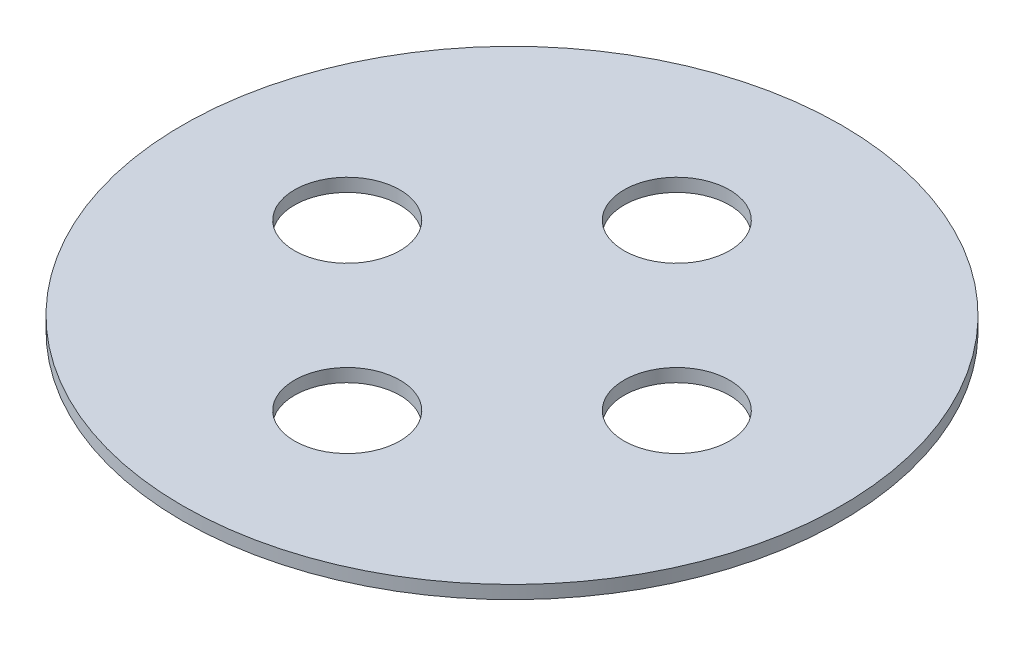
ISO-10303-21;
HEADER;
FILE_DESCRIPTION(('STEP AP214'),'2;1');
FILE_NAME('part.step','',(''),(''),'','','');
FILE_SCHEMA(('AUTOMOTIVE_DESIGN { 1 0 10303 214 1 1 1 1 }'));
ENDSEC;
DATA;
#1=APPLICATION_CONTEXT('core data for automotive mechanical design processes');
#2=APPLICATION_PROTOCOL_DEFINITION('international standard','automotive_design',2000,#1);
#3=PRODUCT_CONTEXT('',#1,'mechanical');
#4=PRODUCT('Part','Part','',(#3));
#5=PRODUCT_RELATED_PRODUCT_CATEGORY('part','',(#4));
#6=PRODUCT_DEFINITION_FORMATION('','',#4);
#7=PRODUCT_DEFINITION_CONTEXT('part definition',#1,'design');
#8=PRODUCT_DEFINITION('design','',#6,#7);
#9=PRODUCT_DEFINITION_SHAPE('','',#8);
#10=(LENGTH_UNIT() NAMED_UNIT(*) SI_UNIT(.MILLI.,.METRE.));
#11=(NAMED_UNIT(*) PLANE_ANGLE_UNIT() SI_UNIT($,.RADIAN.));
#12=(NAMED_UNIT(*) SI_UNIT($,.STERADIAN.) SOLID_ANGLE_UNIT());
#13=UNCERTAINTY_MEASURE_WITH_UNIT(LENGTH_MEASURE(1.E-05),#10,'distance_accuracy_value','');
#14=(GEOMETRIC_REPRESENTATION_CONTEXT(3) GLOBAL_UNCERTAINTY_ASSIGNED_CONTEXT((#13)) GLOBAL_UNIT_ASSIGNED_CONTEXT((#10,
#11,#12)) REPRESENTATION_CONTEXT('',''));
#15=CARTESIAN_POINT('',(0.,0.,0.));
#16=DIRECTION('',(0.,0.,1.));
#17=DIRECTION('',(1.,0.,0.));
#18=AXIS2_PLACEMENT_3D('',#15,#16,#17);
#19=CARTESIAN_POINT('',(0.,1.,0.));
#20=DIRECTION('',(0.,-1.,0.));
#21=DIRECTION('',(0.,0.,-1.));
#22=AXIS2_PLACEMENT_3D('',#19,#20,#21);
#23=CYLINDRICAL_SURFACE('',#22,25.);
#24=CARTESIAN_POINT('',(0.,1.,0.));
#25=DIRECTION('',(0.,1.,0.));
#26=DIRECTION('',(0.,0.,1.));
#27=AXIS2_PLACEMENT_3D('',#24,#25,#26);
#28=CIRCLE('',#27,25.);
#29=CARTESIAN_POINT('',(0.,1.,25.));
#30=VERTEX_POINT('',#29);
#31=EDGE_CURVE('E10',#30,#30,#28,.T.);
#32=ORIENTED_EDGE('',*,*,#31,.F.);
#33=EDGE_LOOP('',(#32));
#34=FACE_BOUND('',#33,.T.);
#35=CARTESIAN_POINT('',(0.,0.,0.));
#36=DIRECTION('',(0.,1.,0.));
#37=DIRECTION('',(0.,0.,1.));
#38=AXIS2_PLACEMENT_3D('',#35,#36,#37);
#39=CIRCLE('',#38,25.);
#40=CARTESIAN_POINT('',(0.,0.,25.));
#41=VERTEX_POINT('',#40);
#42=EDGE_CURVE('E40',#41,#41,#39,.T.);
#43=ORIENTED_EDGE('',*,*,#42,.T.);
#44=EDGE_LOOP('',(#43));
#45=FACE_BOUND('',#44,.T.);
#46=ADVANCED_FACE('F37',(#34,#45),#23,.T.);
#47=CARTESIAN_POINT('',(0.,1.,0.));
#48=DIRECTION('',(0.,1.,0.));
#49=DIRECTION('',(0.,0.,1.));
#50=AXIS2_PLACEMENT_3D('',#47,#48,#49);
#51=PLANE('',#50);
#52=CARTESIAN_POINT('',(0.,1.,-12.5));
#53=DIRECTION('',(0.,1.,0.));
#54=DIRECTION('',(0.,0.,1.));
#55=AXIS2_PLACEMENT_3D('',#52,#53,#54);
#56=CIRCLE('',#55,4.);
#57=CARTESIAN_POINT('',(0.,1.,-8.5));
#58=VERTEX_POINT('',#57);
#59=EDGE_CURVE('E75',#58,#58,#56,.T.);
#60=ORIENTED_EDGE('',*,*,#59,.F.);
#61=EDGE_LOOP('',(#60));
#62=FACE_BOUND('',#61,.T.);
#63=CARTESIAN_POINT('',(12.5,1.,0.));
#64=DIRECTION('',(0.,1.,0.));
#65=DIRECTION('',(0.,0.,1.));
#66=AXIS2_PLACEMENT_3D('',#63,#64,#65);
#67=CIRCLE('',#66,4.);
#68=CARTESIAN_POINT('',(12.5,1.,4.));
#69=VERTEX_POINT('',#68);
#70=EDGE_CURVE('E67',#69,#69,#67,.T.);
#71=ORIENTED_EDGE('',*,*,#70,.F.);
#72=EDGE_LOOP('',(#71));
#73=FACE_BOUND('',#72,.T.);
#74=CARTESIAN_POINT('',(-12.5,1.,0.));
#75=DIRECTION('',(0.,1.,0.));
#76=DIRECTION('',(0.,0.,1.));
#77=AXIS2_PLACEMENT_3D('',#74,#75,#76);
#78=CIRCLE('',#77,4.);
#79=CARTESIAN_POINT('',(-12.5,1.,4.));
#80=VERTEX_POINT('',#79);
#81=EDGE_CURVE('E59',#80,#80,#78,.T.);
#82=ORIENTED_EDGE('',*,*,#81,.F.);
#83=EDGE_LOOP('',(#82));
#84=FACE_BOUND('',#83,.T.);
#85=CARTESIAN_POINT('',(0.,1.,12.5));
#86=DIRECTION('',(0.,1.,0.));
#87=DIRECTION('',(0.,0.,1.));
#88=AXIS2_PLACEMENT_3D('',#85,#86,#87);
#89=CIRCLE('',#88,4.);
#90=CARTESIAN_POINT('',(0.,1.,16.5));
#91=VERTEX_POINT('',#90);
#92=EDGE_CURVE('E51',#91,#91,#89,.T.);
#93=ORIENTED_EDGE('',*,*,#92,.F.);
#94=EDGE_LOOP('',(#93));
#95=FACE_BOUND('',#94,.T.);
#96=ORIENTED_EDGE('',*,*,#31,.T.);
#97=EDGE_LOOP('',(#96));
#98=FACE_BOUND('',#97,.T.);
#99=ADVANCED_FACE('F93',(#62,#73,#84,#95,#98),#51,.T.);
#100=CARTESIAN_POINT('',(0.,0.,0.));
#101=DIRECTION('',(0.,1.,0.));
#102=DIRECTION('',(0.,0.,1.));
#103=AXIS2_PLACEMENT_3D('',#100,#101,#102);
#104=PLANE('',#103);
#105=CARTESIAN_POINT('',(0.,0.,-12.5));
#106=DIRECTION('',(0.,1.,0.));
#107=DIRECTION('',(0.,0.,1.));
#108=AXIS2_PLACEMENT_3D('',#105,#106,#107);
#109=CIRCLE('',#108,4.);
#110=CARTESIAN_POINT('',(0.,0.,-8.5));
#111=VERTEX_POINT('',#110);
#112=EDGE_CURVE('E49',#111,#111,#109,.T.);
#113=ORIENTED_EDGE('',*,*,#112,.T.);
#114=EDGE_LOOP('',(#113));
#115=FACE_BOUND('',#114,.T.);
#116=CARTESIAN_POINT('',(12.5,0.,0.));
#117=DIRECTION('',(0.,1.,0.));
#118=DIRECTION('',(0.,0.,1.));
#119=AXIS2_PLACEMENT_3D('',#116,#117,#118);
#120=CIRCLE('',#119,4.);
#121=CARTESIAN_POINT('',(12.5,0.,4.));
#122=VERTEX_POINT('',#121);
#123=EDGE_CURVE('E71',#122,#122,#120,.T.);
#124=ORIENTED_EDGE('',*,*,#123,.T.);
#125=EDGE_LOOP('',(#124));
#126=FACE_BOUND('',#125,.T.);
#127=CARTESIAN_POINT('',(-12.5,0.,0.));
#128=DIRECTION('',(0.,1.,0.));
#129=DIRECTION('',(0.,0.,1.));
#130=AXIS2_PLACEMENT_3D('',#127,#128,#129);
#131=CIRCLE('',#130,4.);
#132=CARTESIAN_POINT('',(-12.5,0.,4.));
#133=VERTEX_POINT('',#132);
#134=EDGE_CURVE('E63',#133,#133,#131,.T.);
#135=ORIENTED_EDGE('',*,*,#134,.T.);
#136=EDGE_LOOP('',(#135));
#137=FACE_BOUND('',#136,.T.);
#138=CARTESIAN_POINT('',(0.,0.,12.5));
#139=DIRECTION('',(0.,1.,0.));
#140=DIRECTION('',(0.,0.,1.));
#141=AXIS2_PLACEMENT_3D('',#138,#139,#140);
#142=CIRCLE('',#141,4.);
#143=CARTESIAN_POINT('',(0.,0.,16.5));
#144=VERTEX_POINT('',#143);
#145=EDGE_CURVE('E55',#144,#144,#142,.T.);
#146=ORIENTED_EDGE('',*,*,#145,.T.);
#147=EDGE_LOOP('',(#146));
#148=FACE_BOUND('',#147,.T.);
#149=ORIENTED_EDGE('',*,*,#42,.F.);
#150=EDGE_LOOP('',(#149));
#151=FACE_BOUND('',#150,.T.);
#152=ADVANCED_FACE('F83',(#115,#126,#137,#148,#151),#104,.F.);
#153=CARTESIAN_POINT('',(0.,0.,12.5));
#154=DIRECTION('',(0.,1.,0.));
#155=DIRECTION('',(0.,0.,1.));
#156=AXIS2_PLACEMENT_3D('',#153,#154,#155);
#157=CYLINDRICAL_SURFACE('',#156,4.);
#158=ORIENTED_EDGE('',*,*,#145,.F.);
#159=EDGE_LOOP('',(#158));
#160=FACE_BOUND('',#159,.T.);
#161=ORIENTED_EDGE('',*,*,#92,.T.);
#162=EDGE_LOOP('',(#161));
#163=FACE_BOUND('',#162,.T.);
#164=ADVANCED_FACE('F103',(#160,#163),#157,.F.);
#165=CARTESIAN_POINT('',(-12.5,0.,0.));
#166=DIRECTION('',(0.,1.,0.));
#167=DIRECTION('',(0.,0.,1.));
#168=AXIS2_PLACEMENT_3D('',#165,#166,#167);
#169=CYLINDRICAL_SURFACE('',#168,4.);
#170=ORIENTED_EDGE('',*,*,#134,.F.);
#171=EDGE_LOOP('',(#170));
#172=FACE_BOUND('',#171,.T.);
#173=ORIENTED_EDGE('',*,*,#81,.T.);
#174=EDGE_LOOP('',(#173));
#175=FACE_BOUND('',#174,.T.);
#176=ADVANCED_FACE('F105',(#172,#175),#169,.F.);
#177=CARTESIAN_POINT('',(12.5,0.,0.));
#178=DIRECTION('',(0.,1.,0.));
#179=DIRECTION('',(0.,0.,1.));
#180=AXIS2_PLACEMENT_3D('',#177,#178,#179);
#181=CYLINDRICAL_SURFACE('',#180,4.);
#182=ORIENTED_EDGE('',*,*,#123,.F.);
#183=EDGE_LOOP('',(#182));
#184=FACE_BOUND('',#183,.T.);
#185=ORIENTED_EDGE('',*,*,#70,.T.);
#186=EDGE_LOOP('',(#185));
#187=FACE_BOUND('',#186,.T.);
#188=ADVANCED_FACE('F89',(#184,#187),#181,.F.);
#189=CARTESIAN_POINT('',(0.,0.,-12.5));
#190=DIRECTION('',(0.,1.,0.));
#191=DIRECTION('',(0.,0.,1.));
#192=AXIS2_PLACEMENT_3D('',#189,#190,#191);
#193=CYLINDRICAL_SURFACE('',#192,4.);
#194=ORIENTED_EDGE('',*,*,#112,.F.);
#195=EDGE_LOOP('',(#194));
#196=FACE_BOUND('',#195,.T.);
#197=ORIENTED_EDGE('',*,*,#59,.T.);
#198=EDGE_LOOP('',(#197));
#199=FACE_BOUND('',#198,.T.);
#200=ADVANCED_FACE('F86',(#196,#199),#193,.F.);
#201=CLOSED_SHELL('',(#46,#99,#152,#164,#176,#188,#200));
#202=MANIFOLD_SOLID_BREP('B2',#201);
#203=ADVANCED_BREP_SHAPE_REPRESENTATION('',(#18,#202),#14);
#204=SHAPE_DEFINITION_REPRESENTATION(#9,#203);
ENDSEC;
END-ISO-10303-21;
